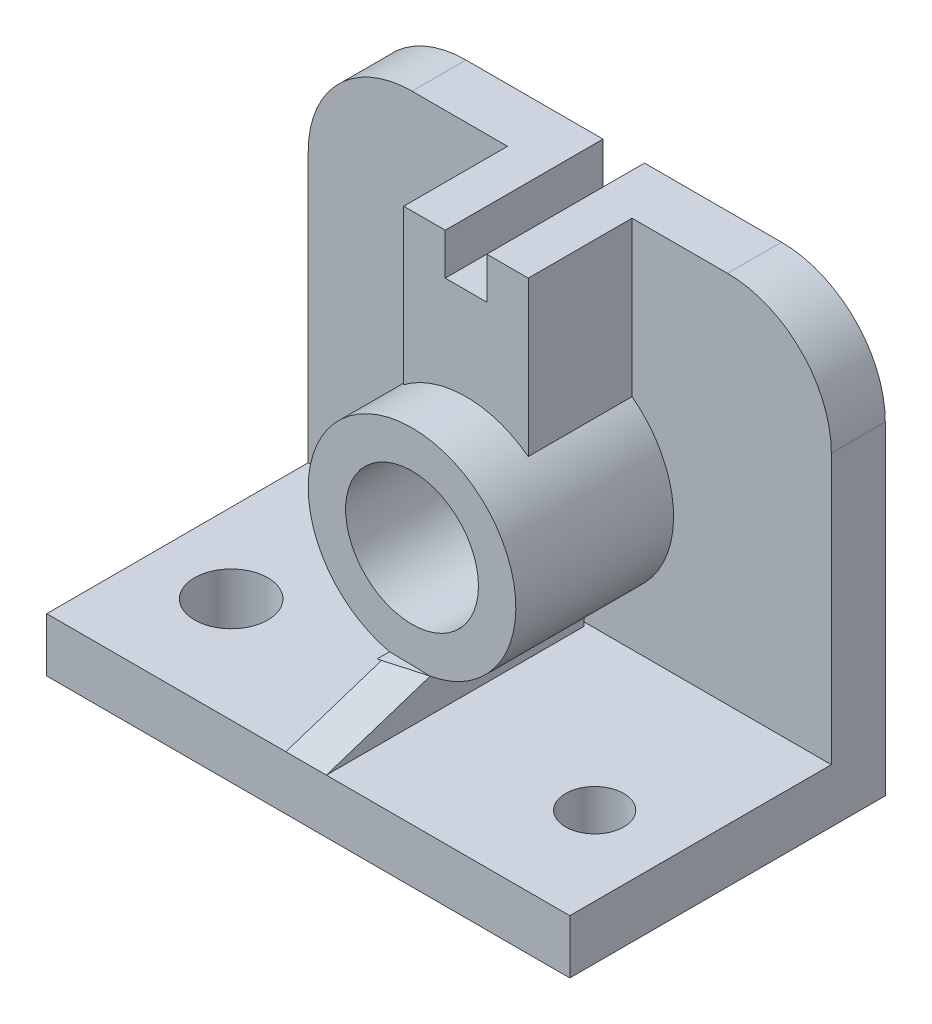
ISO-10303-21;
HEADER;
FILE_DESCRIPTION(('STEP AP214'),'2;1');
FILE_NAME('part.step','',(''),(''),'','','');
FILE_SCHEMA(('AUTOMOTIVE_DESIGN { 1 0 10303 214 1 1 1 1 }'));
ENDSEC;
DATA;
#1=APPLICATION_CONTEXT('core data for automotive mechanical design processes');
#2=APPLICATION_PROTOCOL_DEFINITION('international standard','automotive_design',2000,#1);
#3=PRODUCT_CONTEXT('',#1,'mechanical');
#4=PRODUCT('Part','Part','',(#3));
#5=PRODUCT_RELATED_PRODUCT_CATEGORY('part','',(#4));
#6=PRODUCT_DEFINITION_FORMATION('','',#4);
#7=PRODUCT_DEFINITION_CONTEXT('part definition',#1,'design');
#8=PRODUCT_DEFINITION('design','',#6,#7);
#9=PRODUCT_DEFINITION_SHAPE('','',#8);
#10=(LENGTH_UNIT() NAMED_UNIT(*) SI_UNIT(.MILLI.,.METRE.));
#11=(NAMED_UNIT(*) PLANE_ANGLE_UNIT() SI_UNIT($,.RADIAN.));
#12=(NAMED_UNIT(*) SI_UNIT($,.STERADIAN.) SOLID_ANGLE_UNIT());
#13=UNCERTAINTY_MEASURE_WITH_UNIT(LENGTH_MEASURE(1.E-05),#10,'distance_accuracy_value','');
#14=(GEOMETRIC_REPRESENTATION_CONTEXT(3) GLOBAL_UNCERTAINTY_ASSIGNED_CONTEXT((#13)) GLOBAL_UNIT_ASSIGNED_CONTEXT((#10,
#11,#12)) REPRESENTATION_CONTEXT('',''));
#15=CARTESIAN_POINT('',(0.,0.,0.));
#16=DIRECTION('',(0.,0.,1.));
#17=DIRECTION('',(1.,0.,0.));
#18=AXIS2_PLACEMENT_3D('',#15,#16,#17);
#19=CARTESIAN_POINT('',(9.06474820143882,45.7756538208969,51.5971223021583));
#20=DIRECTION('',(0.,0.,-1.));
#21=DIRECTION('',(-1.,0.,0.));
#22=AXIS2_PLACEMENT_3D('',#19,#20,#21);
#23=CYLINDRICAL_SURFACE('',#22,25.);
#24=CARTESIAN_POINT('',(9.06474820143882,45.7756538208969,38.5971223021583));
#25=DIRECTION('',(0.,0.,-1.));
#26=DIRECTION('',(1.,0.,0.));
#27=AXIS2_PLACEMENT_3D('',#24,#25,#26);
#28=CIRCLE('',#27,25.);
#29=CARTESIAN_POINT('',(-5.93525179856118,65.7756538208969,38.5971223021583));
#30=VERTEX_POINT('',#29);
#31=CARTESIAN_POINT('',(24.0647482014388,65.7756538208969,38.5971223021583));
#32=VERTEX_POINT('',#31);
#33=EDGE_CURVE('E319',#30,#32,#28,.T.);
#34=ORIENTED_EDGE('',*,*,#33,.F.);
#35=DIRECTION('',(0.,0.,-1.));
#36=VECTOR('',#35,1.);
#37=CARTESIAN_POINT('',(-5.93525179856118,65.7756538208969,38.5971223021583));
#38=LINE('',#37,#36);
#39=CARTESIAN_POINT('',(-5.93525179856117,65.7756538208969,13.5971223021583));
#40=VERTEX_POINT('',#39);
#41=EDGE_CURVE('E343',#30,#40,#38,.T.);
#42=ORIENTED_EDGE('',*,*,#41,.T.);
#43=CARTESIAN_POINT('',(9.06474820143882,45.7756538208969,13.5971223021583));
#44=DIRECTION('',(0.,0.,-1.));
#45=DIRECTION('',(-1.,0.,0.));
#46=AXIS2_PLACEMENT_3D('',#43,#44,#45);
#47=CIRCLE('',#46,25.);
#48=CARTESIAN_POINT('',(24.0647482014388,65.7756538208969,13.5971223021583));
#49=VERTEX_POINT('',#48);
#50=EDGE_CURVE('E301',#40,#49,#47,.F.);
#51=ORIENTED_EDGE('',*,*,#50,.T.);
#52=DIRECTION('',(0.,0.,-1.));
#53=VECTOR('',#52,1.);
#54=CARTESIAN_POINT('',(24.0647482014388,65.7756538208969,38.5971223021583));
#55=LINE('',#54,#53);
#56=EDGE_CURVE('E340',#32,#49,#55,.T.);
#57=ORIENTED_EDGE('',*,*,#56,.F.);
#58=EDGE_LOOP('',(#34,#42,#51,#57));
#59=FACE_BOUND('',#58,.T.);
#60=DIRECTION('',(0.,0.,-1.));
#61=VECTOR('',#60,1.);
#62=CARTESIAN_POINT('',(3.66037439900069,21.3667877308156,88.5971223021583));
#63=LINE('',#62,#61);
#64=CARTESIAN_POINT('',(3.66037439900069,21.3667877308156,51.5971223021583));
#65=VERTEX_POINT('',#64);
#66=CARTESIAN_POINT('',(3.66037439900069,21.3667877308156,14.5971223021583));
#67=VERTEX_POINT('',#66);
#68=EDGE_CURVE('E374',#65,#67,#63,.T.);
#69=ORIENTED_EDGE('',*,*,#68,.F.);
#70=CARTESIAN_POINT('',(9.06474820143882,45.7756538208969,51.5971223021583));
#71=DIRECTION('',(0.,0.,1.));
#72=DIRECTION('',(1.,0.,0.));
#73=AXIS2_PLACEMENT_3D('',#70,#71,#72);
#74=CIRCLE('',#73,25.);
#75=CARTESIAN_POINT('',(13.4310564952909,21.159899680854,51.5971223021583));
#76=VERTEX_POINT('',#75);
#77=EDGE_CURVE('E227',#76,#65,#74,.T.);
#78=ORIENTED_EDGE('',*,*,#77,.F.);
#79=DIRECTION('',(0.,0.,-1.));
#80=VECTOR('',#79,1.);
#81=CARTESIAN_POINT('',(13.4310564952909,21.159899680854,88.5971223021583));
#82=LINE('',#81,#80);
#83=CARTESIAN_POINT('',(13.4310564952909,21.159899680854,14.5971223021583));
#84=VERTEX_POINT('',#83);
#85=EDGE_CURVE('E213',#76,#84,#82,.T.);
#86=ORIENTED_EDGE('',*,*,#85,.T.);
#87=CARTESIAN_POINT('',(9.06474820143882,45.7756538208969,14.5971223021583));
#88=DIRECTION('',(0.,0.,1.));
#89=DIRECTION('',(1.,0.,0.));
#90=AXIS2_PLACEMENT_3D('',#87,#88,#89);
#91=CIRCLE('',#90,25.);
#92=EDGE_CURVE('E208',#67,#84,#91,.T.);
#93=ORIENTED_EDGE('',*,*,#92,.F.);
#94=EDGE_LOOP('',(#69,#78,#86,#93));
#95=FACE_BOUND('',#94,.T.);
#96=ADVANCED_FACE('F36',(#59,#95),#23,.T.);
#97=CARTESIAN_POINT('',(0.,13.,0.));
#98=DIRECTION('',(0.,1.,0.));
#99=DIRECTION('',(0.,0.,1.));
#100=AXIS2_PLACEMENT_3D('',#97,#98,#99);
#101=PLANE('',#100);
#102=CARTESIAN_POINT('',(53.0647482014388,13.,51.5971223021583));
#103=DIRECTION('',(0.,1.,0.));
#104=DIRECTION('',(0.,0.,1.));
#105=AXIS2_PLACEMENT_3D('',#102,#103,#104);
#106=CIRCLE('',#105,7.);
#107=CARTESIAN_POINT('',(53.0647482014388,13.,58.5971223021583));
#108=VERTEX_POINT('',#107);
#109=EDGE_CURVE('E211',#108,#108,#106,.T.);
#110=ORIENTED_EDGE('',*,*,#109,.F.);
#111=EDGE_LOOP('',(#110));
#112=FACE_BOUND('',#111,.T.);
#113=CARTESIAN_POINT('',(-34.8088545675727,13.,51.2901142982248));
#114=DIRECTION('',(0.,1.,0.));
#115=DIRECTION('',(0.,0.,1.));
#116=AXIS2_PLACEMENT_3D('',#113,#114,#115);
#117=CIRCLE('',#116,8.82990747552434);
#118=CARTESIAN_POINT('',(-34.8088545675727,13.,60.1200217737491));
#119=VERTEX_POINT('',#118);
#120=EDGE_CURVE('E220',#119,#119,#117,.T.);
#121=ORIENTED_EDGE('',*,*,#120,.F.);
#122=EDGE_LOOP('',(#121));
#123=FACE_BOUND('',#122,.T.);
#124=DIRECTION('',(1.,0.,0.));
#125=VECTOR('',#124,1.);
#126=CARTESIAN_POINT('',(-53.9352517985612,13.,76.5971223021583));
#127=LINE('',#126,#125);
#128=CARTESIAN_POINT('',(-53.9352517985612,13.,76.5971223021583));
#129=VERTEX_POINT('',#128);
#130=CARTESIAN_POINT('',(3.66037439900069,13.,76.5971223021583));
#131=VERTEX_POINT('',#130);
#132=EDGE_CURVE('E176',#129,#131,#127,.T.);
#133=ORIENTED_EDGE('',*,*,#132,.T.);
#134=DIRECTION('',(0.,0.,-1.));
#135=VECTOR('',#134,1.);
#136=CARTESIAN_POINT('',(3.66037439900069,13.,88.5971223021583));
#137=LINE('',#136,#135);
#138=CARTESIAN_POINT('',(3.66037439900069,13.,14.5971223021583));
#139=VERTEX_POINT('',#138);
#140=EDGE_CURVE('E56',#131,#139,#137,.T.);
#141=ORIENTED_EDGE('',*,*,#140,.T.);
#142=DIRECTION('',(1.,0.,0.));
#143=VECTOR('',#142,1.);
#144=CARTESIAN_POINT('',(13.4310564952909,13.,14.5971223021583));
#145=LINE('',#144,#143);
#146=CARTESIAN_POINT('',(13.4310564952909,13.,14.5971223021583));
#147=VERTEX_POINT('',#146);
#148=EDGE_CURVE('E51',#139,#147,#145,.T.);
#149=ORIENTED_EDGE('',*,*,#148,.T.);
#150=DIRECTION('',(0.,0.,-1.));
#151=VECTOR('',#150,1.);
#152=CARTESIAN_POINT('',(13.4310564952909,13.,88.5971223021583));
#153=LINE('',#152,#151);
#154=CARTESIAN_POINT('',(13.4310564952909,13.,76.5971223021583));
#155=VERTEX_POINT('',#154);
#156=EDGE_CURVE('E209',#155,#147,#153,.T.);
#157=ORIENTED_EDGE('',*,*,#156,.F.);
#158=CARTESIAN_POINT('',(72.0647482014388,13.,76.5971223021583));
#159=VERTEX_POINT('',#158);
#160=EDGE_CURVE('E189',#155,#159,#127,.T.);
#161=ORIENTED_EDGE('',*,*,#160,.T.);
#162=DIRECTION('',(0.,0.,-1.));
#163=VECTOR('',#162,1.);
#164=CARTESIAN_POINT('',(72.0647482014388,13.,0.59712230215829));
#165=LINE('',#164,#163);
#166=CARTESIAN_POINT('',(72.0647482014388,13.,13.5971223021583));
#167=VERTEX_POINT('',#166);
#168=EDGE_CURVE('E278',#159,#167,#165,.T.);
#169=ORIENTED_EDGE('',*,*,#168,.T.);
#170=DIRECTION('',(-1.,0.,0.));
#171=VECTOR('',#170,1.);
#172=CARTESIAN_POINT('',(72.0647482014388,13.,13.5971223021583));
#173=LINE('',#172,#171);
#174=CARTESIAN_POINT('',(-53.9352517985612,13.,13.5971223021583));
#175=VERTEX_POINT('',#174);
#176=EDGE_CURVE('E280',#167,#175,#173,.T.);
#177=ORIENTED_EDGE('',*,*,#176,.T.);
#178=DIRECTION('',(0.,0.,1.));
#179=VECTOR('',#178,1.);
#180=CARTESIAN_POINT('',(-53.9352517985612,13.,0.59712230215829));
#181=LINE('',#180,#179);
#182=EDGE_CURVE('E181',#175,#129,#181,.T.);
#183=ORIENTED_EDGE('',*,*,#182,.T.);
#184=EDGE_LOOP('',(#133,#141,#149,#157,#161,#169,#177,#183));
#185=FACE_BOUND('',#184,.T.);
#186=ADVANCED_FACE('F178',(#112,#123,#185),#101,.T.);
#187=CARTESIAN_POINT('',(9.06474820143882,45.7756538208969,51.5971223021583));
#188=DIRECTION('',(0.,0.,1.));
#189=DIRECTION('',(1.,0.,0.));
#190=AXIS2_PLACEMENT_3D('',#187,#188,#189);
#191=PLANE('',#190);
#192=CARTESIAN_POINT('',(9.06474820143882,45.7756538208969,51.5971223021583));
#193=DIRECTION('',(0.,0.,1.));
#194=DIRECTION('',(1.,0.,0.));
#195=AXIS2_PLACEMENT_3D('',#192,#193,#194);
#196=CIRCLE('',#195,16.);
#197=CARTESIAN_POINT('',(25.0647482014388,45.7756538208969,51.5971223021583));
#198=VERTEX_POINT('',#197);
#199=EDGE_CURVE('E228',#198,#198,#196,.T.);
#200=ORIENTED_EDGE('',*,*,#199,.F.);
#201=EDGE_LOOP('',(#200));
#202=FACE_BOUND('',#201,.T.);
#203=ORIENTED_EDGE('',*,*,#77,.T.);
#204=DIRECTION('',(0.99977589835616,-0.0211696260272393,0.));
#205=VECTOR('',#204,1.);
#206=CARTESIAN_POINT('',(8.5457154471458,21.2633437058348,51.5971223021583));
#207=LINE('',#206,#205);
#208=EDGE_CURVE('E348',#65,#76,#207,.T.);
#209=ORIENTED_EDGE('',*,*,#208,.T.);
#210=EDGE_LOOP('',(#203,#209));
#211=FACE_BOUND('',#210,.T.);
#212=ADVANCED_FACE('F373',(#202,#211),#191,.T.);
#213=CARTESIAN_POINT('',(72.0647482014388,103.,13.5971223021583));
#214=DIRECTION('',(0.,1.,0.));
#215=DIRECTION('',(0.,0.,1.));
#216=AXIS2_PLACEMENT_3D('',#213,#214,#215);
#217=PLANE('',#216);
#218=DIRECTION('',(-1.,0.,0.));
#219=VECTOR('',#218,1.);
#220=CARTESIAN_POINT('',(4.06474820143882,103.,38.5971223021583));
#221=LINE('',#220,#219);
#222=CARTESIAN_POINT('',(4.06474820143882,103.,38.5971223021583));
#223=VERTEX_POINT('',#222);
#224=CARTESIAN_POINT('',(-5.93525179856118,103.,38.5971223021583));
#225=VERTEX_POINT('',#224);
#226=EDGE_CURVE('E313',#223,#225,#221,.T.);
#227=ORIENTED_EDGE('',*,*,#226,.F.);
#228=DIRECTION('',(0.,0.,1.));
#229=VECTOR('',#228,1.);
#230=CARTESIAN_POINT('',(4.06474820143882,103.,0.59712230215829));
#231=LINE('',#230,#229);
#232=CARTESIAN_POINT('',(4.06474820143882,103.,0.59712230215829));
#233=VERTEX_POINT('',#232);
#234=EDGE_CURVE('E297',#233,#223,#231,.T.);
#235=ORIENTED_EDGE('',*,*,#234,.F.);
#236=DIRECTION('',(1.,0.,0.));
#237=VECTOR('',#236,1.);
#238=CARTESIAN_POINT('',(72.0647482014388,103.,0.59712230215829));
#239=LINE('',#238,#237);
#240=CARTESIAN_POINT('',(-28.9352517985612,103.,0.59712230215829));
#241=VERTEX_POINT('',#240);
#242=EDGE_CURVE('E274',#241,#233,#239,.T.);
#243=ORIENTED_EDGE('',*,*,#242,.F.);
#244=DIRECTION('',(0.,0.,-1.));
#245=VECTOR('',#244,1.);
#246=CARTESIAN_POINT('',(-28.9352517985612,103.,13.5971223021583));
#247=LINE('',#246,#245);
#248=CARTESIAN_POINT('',(-28.9352517985612,103.,13.5971223021583));
#249=VERTEX_POINT('',#248);
#250=EDGE_CURVE('E233',#241,#249,#247,.F.);
#251=ORIENTED_EDGE('',*,*,#250,.T.);
#252=DIRECTION('',(1.,0.,0.));
#253=VECTOR('',#252,1.);
#254=CARTESIAN_POINT('',(72.0647482014388,103.,13.5971223021583));
#255=LINE('',#254,#253);
#256=CARTESIAN_POINT('',(-5.93525179856118,103.,13.5971223021583));
#257=VERTEX_POINT('',#256);
#258=EDGE_CURVE('E260',#249,#257,#255,.T.);
#259=ORIENTED_EDGE('',*,*,#258,.T.);
#260=DIRECTION('',(0.,0.,-1.));
#261=VECTOR('',#260,1.);
#262=CARTESIAN_POINT('',(-5.93525179856118,103.,38.5971223021583));
#263=LINE('',#262,#261);
#264=EDGE_CURVE('E345',#225,#257,#263,.T.);
#265=ORIENTED_EDGE('',*,*,#264,.F.);
#266=EDGE_LOOP('',(#227,#235,#243,#251,#259,#265));
#267=FACE_BOUND('',#266,.T.);
#268=ADVANCED_FACE('F456',(#267),#217,.T.);
#269=DIRECTION('',(0.,0.,-1.));
#270=VECTOR('',#269,1.);
#271=CARTESIAN_POINT('',(14.0647482014388,103.,0.59712230215829));
#272=LINE('',#271,#270);
#273=CARTESIAN_POINT('',(14.0647482014388,103.,38.5971223021583));
#274=VERTEX_POINT('',#273);
#275=CARTESIAN_POINT('',(14.0647482014388,103.,0.59712230215829));
#276=VERTEX_POINT('',#275);
#277=EDGE_CURVE('E296',#274,#276,#272,.T.);
#278=ORIENTED_EDGE('',*,*,#277,.F.);
#279=DIRECTION('',(-1.,0.,0.));
#280=VECTOR('',#279,1.);
#281=CARTESIAN_POINT('',(14.0647482014388,103.,38.5971223021583));
#282=LINE('',#281,#280);
#283=CARTESIAN_POINT('',(24.0647482014388,103.,38.5971223021583));
#284=VERTEX_POINT('',#283);
#285=EDGE_CURVE('E324',#284,#274,#282,.T.);
#286=ORIENTED_EDGE('',*,*,#285,.F.);
#287=DIRECTION('',(0.,0.,-1.));
#288=VECTOR('',#287,1.);
#289=CARTESIAN_POINT('',(24.0647482014388,103.,38.5971223021583));
#290=LINE('',#289,#288);
#291=CARTESIAN_POINT('',(24.0647482014388,103.,13.5971223021583));
#292=VERTEX_POINT('',#291);
#293=EDGE_CURVE('E333',#284,#292,#290,.T.);
#294=ORIENTED_EDGE('',*,*,#293,.T.);
#295=CARTESIAN_POINT('',(47.0647482014388,103.,13.5971223021583));
#296=VERTEX_POINT('',#295);
#297=EDGE_CURVE('E255',#292,#296,#255,.T.);
#298=ORIENTED_EDGE('',*,*,#297,.T.);
#299=DIRECTION('',(0.,0.,-1.));
#300=VECTOR('',#299,1.);
#301=CARTESIAN_POINT('',(47.0647482014388,103.,0.597122302158295));
#302=LINE('',#301,#300);
#303=CARTESIAN_POINT('',(47.0647482014388,103.,0.59712230215829));
#304=VERTEX_POINT('',#303);
#305=EDGE_CURVE('E244',#296,#304,#302,.T.);
#306=ORIENTED_EDGE('',*,*,#305,.T.);
#307=EDGE_CURVE('E252',#276,#304,#239,.T.);
#308=ORIENTED_EDGE('',*,*,#307,.F.);
#309=EDGE_LOOP('',(#278,#286,#294,#298,#306,#308));
#310=FACE_BOUND('',#309,.T.);
#311=ADVANCED_FACE('F38',(#310),#217,.T.);
#312=CARTESIAN_POINT('',(-5.93525179856118,103.,38.5971223021583));
#313=DIRECTION('',(1.,0.,0.));
#314=DIRECTION('',(0.,1.,0.));
#315=AXIS2_PLACEMENT_3D('',#312,#313,#314);
#316=PLANE('',#315);
#317=DIRECTION('',(0.,-1.,0.));
#318=VECTOR('',#317,1.);
#319=CARTESIAN_POINT('',(-5.93525179856118,103.,13.5971223021583));
#320=LINE('',#319,#318);
#321=EDGE_CURVE('E309',#257,#40,#320,.T.);
#322=ORIENTED_EDGE('',*,*,#321,.T.);
#323=ORIENTED_EDGE('',*,*,#41,.F.);
#324=DIRECTION('',(0.,-1.,0.));
#325=VECTOR('',#324,1.);
#326=CARTESIAN_POINT('',(-5.93525179856118,103.,38.5971223021583));
#327=LINE('',#326,#325);
#328=EDGE_CURVE('E316',#225,#30,#327,.T.);
#329=ORIENTED_EDGE('',*,*,#328,.F.);
#330=ORIENTED_EDGE('',*,*,#264,.T.);
#331=EDGE_LOOP('',(#322,#323,#329,#330));
#332=FACE_BOUND('',#331,.T.);
#333=ADVANCED_FACE('F449',(#332),#316,.F.);
#334=CARTESIAN_POINT('',(24.0647482014388,103.,38.5971223021583));
#335=DIRECTION('',(-1.,0.,0.));
#336=DIRECTION('',(0.,0.,1.));
#337=AXIS2_PLACEMENT_3D('',#334,#335,#336);
#338=PLANE('',#337);
#339=DIRECTION('',(0.,1.,0.));
#340=VECTOR('',#339,1.);
#341=CARTESIAN_POINT('',(24.0647482014388,103.,13.5971223021583));
#342=LINE('',#341,#340);
#343=EDGE_CURVE('E314',#49,#292,#342,.T.);
#344=ORIENTED_EDGE('',*,*,#343,.T.);
#345=ORIENTED_EDGE('',*,*,#293,.F.);
#346=DIRECTION('',(0.,1.,0.));
#347=VECTOR('',#346,1.);
#348=CARTESIAN_POINT('',(24.0647482014388,103.,38.5971223021583));
#349=LINE('',#348,#347);
#350=EDGE_CURVE('E322',#32,#284,#349,.T.);
#351=ORIENTED_EDGE('',*,*,#350,.F.);
#352=ORIENTED_EDGE('',*,*,#56,.T.);
#353=EDGE_LOOP('',(#344,#345,#351,#352));
#354=FACE_BOUND('',#353,.T.);
#355=ADVANCED_FACE('F446',(#354),#338,.F.);
#356=CARTESIAN_POINT('',(9.06474820143882,45.7756538208969,38.5971223021583));
#357=DIRECTION('',(0.,0.,1.));
#358=DIRECTION('',(1.,0.,0.));
#359=AXIS2_PLACEMENT_3D('',#356,#357,#358);
#360=PLANE('',#359);
#361=DIRECTION('',(0.,1.,0.));
#362=VECTOR('',#361,1.);
#363=CARTESIAN_POINT('',(4.06474820143882,93.,38.5971223021583));
#364=LINE('',#363,#362);
#365=CARTESIAN_POINT('',(4.06474820143882,93.,38.5971223021583));
#366=VERTEX_POINT('',#365);
#367=EDGE_CURVE('E310',#366,#223,#364,.T.);
#368=ORIENTED_EDGE('',*,*,#367,.T.);
#369=ORIENTED_EDGE('',*,*,#226,.T.);
#370=ORIENTED_EDGE('',*,*,#328,.T.);
#371=ORIENTED_EDGE('',*,*,#33,.T.);
#372=ORIENTED_EDGE('',*,*,#350,.T.);
#373=ORIENTED_EDGE('',*,*,#285,.T.);
#374=DIRECTION('',(0.,-1.,0.));
#375=VECTOR('',#374,1.);
#376=CARTESIAN_POINT('',(14.0647482014388,103.,38.5971223021583));
#377=LINE('',#376,#375);
#378=CARTESIAN_POINT('',(14.0647482014388,93.,38.5971223021583));
#379=VERTEX_POINT('',#378);
#380=EDGE_CURVE('E327',#274,#379,#377,.T.);
#381=ORIENTED_EDGE('',*,*,#380,.T.);
#382=DIRECTION('',(-1.,0.,0.));
#383=VECTOR('',#382,1.);
#384=CARTESIAN_POINT('',(14.0647482014388,93.,38.5971223021583));
#385=LINE('',#384,#383);
#386=EDGE_CURVE('E330',#379,#366,#385,.T.);
#387=ORIENTED_EDGE('',*,*,#386,.T.);
#388=EDGE_LOOP('',(#368,#369,#370,#371,#372,#373,#381,#387));
#389=FACE_BOUND('',#388,.T.);
#390=ADVANCED_FACE('F430',(#389),#360,.T.);
#391=CARTESIAN_POINT('',(0.,0.,13.5971223021583));
#392=DIRECTION('',(0.,0.,-1.));
#393=DIRECTION('',(-1.,0.,0.));
#394=AXIS2_PLACEMENT_3D('',#391,#392,#393);
#395=PLANE('',#394);
#396=ORIENTED_EDGE('',*,*,#50,.F.);
#397=ORIENTED_EDGE('',*,*,#321,.F.);
#398=ORIENTED_EDGE('',*,*,#258,.F.);
#399=CARTESIAN_POINT('',(-28.9352517985612,78.,13.5971223021583));
#400=DIRECTION('',(0.,0.,-1.));
#401=DIRECTION('',(-1.,0.,0.));
#402=AXIS2_PLACEMENT_3D('',#399,#400,#401);
#403=CIRCLE('',#402,25.);
#404=CARTESIAN_POINT('',(-53.9352517985612,78.,13.5971223021583));
#405=VERTEX_POINT('',#404);
#406=EDGE_CURVE('E242',#249,#405,#403,.F.);
#407=ORIENTED_EDGE('',*,*,#406,.T.);
#408=DIRECTION('',(0.,1.,0.));
#409=VECTOR('',#408,1.);
#410=CARTESIAN_POINT('',(-53.9352517985612,13.,13.5971223021583));
#411=LINE('',#410,#409);
#412=EDGE_CURVE('E186',#175,#405,#411,.T.);
#413=ORIENTED_EDGE('',*,*,#412,.F.);
#414=ORIENTED_EDGE('',*,*,#176,.F.);
#415=DIRECTION('',(0.,-1.,0.));
#416=VECTOR('',#415,1.);
#417=CARTESIAN_POINT('',(72.0647482014388,13.,13.5971223021583));
#418=LINE('',#417,#416);
#419=CARTESIAN_POINT('',(72.0647482014388,78.,13.5971223021583));
#420=VERTEX_POINT('',#419);
#421=EDGE_CURVE('E247',#420,#167,#418,.T.);
#422=ORIENTED_EDGE('',*,*,#421,.F.);
#423=CARTESIAN_POINT('',(47.0647482014388,78.,13.5971223021583));
#424=DIRECTION('',(0.,0.,-1.));
#425=DIRECTION('',(-1.,0.,0.));
#426=AXIS2_PLACEMENT_3D('',#423,#424,#425);
#427=CIRCLE('',#426,25.);
#428=EDGE_CURVE('E238',#420,#296,#427,.F.);
#429=ORIENTED_EDGE('',*,*,#428,.T.);
#430=ORIENTED_EDGE('',*,*,#297,.F.);
#431=ORIENTED_EDGE('',*,*,#343,.F.);
#432=EDGE_LOOP('',(#396,#397,#398,#407,#413,#414,#422,#429,#430,#431));
#433=FACE_BOUND('',#432,.T.);
#434=ADVANCED_FACE('F413',(#433),#395,.F.);
#435=CARTESIAN_POINT('',(-53.9352517985612,13.,0.59712230215829));
#436=DIRECTION('',(1.,0.,0.));
#437=DIRECTION('',(0.,0.,-1.));
#438=AXIS2_PLACEMENT_3D('',#435,#436,#437);
#439=PLANE('',#438);
#440=ORIENTED_EDGE('',*,*,#412,.T.);
#441=DIRECTION('',(0.,0.,-1.));
#442=VECTOR('',#441,1.);
#443=CARTESIAN_POINT('',(-53.9352517985612,78.,0.59712230215829));
#444=LINE('',#443,#442);
#445=CARTESIAN_POINT('',(-53.9352517985612,78.,0.59712230215829));
#446=VERTEX_POINT('',#445);
#447=EDGE_CURVE('E234',#405,#446,#444,.T.);
#448=ORIENTED_EDGE('',*,*,#447,.T.);
#449=DIRECTION('',(0.,-1.,0.));
#450=VECTOR('',#449,1.);
#451=CARTESIAN_POINT('',(-53.9352517985612,13.,0.59712230215829));
#452=LINE('',#451,#450);
#453=CARTESIAN_POINT('',(-53.9352517985612,0.,0.59712230215829));
#454=VERTEX_POINT('',#453);
#455=EDGE_CURVE('E237',#446,#454,#452,.T.);
#456=ORIENTED_EDGE('',*,*,#455,.T.);
#457=DIRECTION('',(0.,0.,1.));
#458=VECTOR('',#457,1.);
#459=CARTESIAN_POINT('',(-53.9352517985612,0.,0.59712230215829));
#460=LINE('',#459,#458);
#461=CARTESIAN_POINT('',(-53.9352517985612,0.,76.5971223021583));
#462=VERTEX_POINT('',#461);
#463=EDGE_CURVE('E269',#454,#462,#460,.T.);
#464=ORIENTED_EDGE('',*,*,#463,.T.);
#465=DIRECTION('',(0.,-1.,0.));
#466=VECTOR('',#465,1.);
#467=CARTESIAN_POINT('',(-53.9352517985612,13.,76.5971223021583));
#468=LINE('',#467,#466);
#469=EDGE_CURVE('E248',#129,#462,#468,.T.);
#470=ORIENTED_EDGE('',*,*,#469,.F.);
#471=ORIENTED_EDGE('',*,*,#182,.F.);
#472=EDGE_LOOP('',(#440,#448,#456,#464,#470,#471));
#473=FACE_BOUND('',#472,.T.);
#474=ADVANCED_FACE('F410',(#473),#439,.F.);
#475=CARTESIAN_POINT('',(-53.9352517985612,13.,76.5971223021583));
#476=DIRECTION('',(0.,0.,-1.));
#477=DIRECTION('',(-1.,0.,0.));
#478=AXIS2_PLACEMENT_3D('',#475,#476,#477);
#479=PLANE('',#478);
#480=DIRECTION('',(1.,0.,0.));
#481=VECTOR('',#480,1.);
#482=CARTESIAN_POINT('',(-53.9352517985612,0.,76.5971223021583));
#483=LINE('',#482,#481);
#484=CARTESIAN_POINT('',(72.0647482014388,0.,76.5971223021583));
#485=VERTEX_POINT('',#484);
#486=EDGE_CURVE('E262',#462,#485,#483,.T.);
#487=ORIENTED_EDGE('',*,*,#486,.T.);
#488=DIRECTION('',(0.,-1.,0.));
#489=VECTOR('',#488,1.);
#490=CARTESIAN_POINT('',(72.0647482014388,13.,76.5971223021583));
#491=LINE('',#490,#489);
#492=EDGE_CURVE('E263',#159,#485,#491,.T.);
#493=ORIENTED_EDGE('',*,*,#492,.F.);
#494=ORIENTED_EDGE('',*,*,#160,.F.);
#495=EDGE_CURVE('E187',#131,#155,#127,.T.);
#496=ORIENTED_EDGE('',*,*,#495,.F.);
#497=ORIENTED_EDGE('',*,*,#132,.F.);
#498=ORIENTED_EDGE('',*,*,#469,.T.);
#499=EDGE_LOOP('',(#487,#493,#494,#496,#497,#498));
#500=FACE_BOUND('',#499,.T.);
#501=ADVANCED_FACE('F203',(#500),#479,.F.);
#502=CARTESIAN_POINT('',(72.0647482014388,13.,0.59712230215829));
#503=DIRECTION('',(-1.,0.,0.));
#504=DIRECTION('',(0.,0.,1.));
#505=AXIS2_PLACEMENT_3D('',#502,#503,#504);
#506=PLANE('',#505);
#507=DIRECTION('',(0.,-1.,0.));
#508=VECTOR('',#507,1.);
#509=CARTESIAN_POINT('',(72.0647482014388,13.,0.59712230215829));
#510=LINE('',#509,#508);
#511=CARTESIAN_POINT('',(72.0647482014388,78.,0.59712230215829));
#512=VERTEX_POINT('',#511);
#513=CARTESIAN_POINT('',(72.0647482014388,0.,0.59712230215829));
#514=VERTEX_POINT('',#513);
#515=EDGE_CURVE('E251',#512,#514,#510,.T.);
#516=ORIENTED_EDGE('',*,*,#515,.F.);
#517=DIRECTION('',(0.,0.,-1.));
#518=VECTOR('',#517,1.);
#519=CARTESIAN_POINT('',(72.0647482014388,78.,13.5971223021583));
#520=LINE('',#519,#518);
#521=EDGE_CURVE('E245',#512,#420,#520,.F.);
#522=ORIENTED_EDGE('',*,*,#521,.T.);
#523=ORIENTED_EDGE('',*,*,#421,.T.);
#524=ORIENTED_EDGE('',*,*,#168,.F.);
#525=ORIENTED_EDGE('',*,*,#492,.T.);
#526=DIRECTION('',(0.,0.,-1.));
#527=VECTOR('',#526,1.);
#528=CARTESIAN_POINT('',(72.0647482014388,0.,0.59712230215829));
#529=LINE('',#528,#527);
#530=EDGE_CURVE('E266',#485,#514,#529,.T.);
#531=ORIENTED_EDGE('',*,*,#530,.T.);
#532=EDGE_LOOP('',(#516,#522,#523,#524,#525,#531));
#533=FACE_BOUND('',#532,.T.);
#534=ADVANCED_FACE('F417',(#533),#506,.F.);
#535=CARTESIAN_POINT('',(-53.9352517985612,13.,0.59712230215829));
#536=DIRECTION('',(0.,0.,1.));
#537=DIRECTION('',(1.,0.,0.));
#538=AXIS2_PLACEMENT_3D('',#535,#536,#537);
#539=PLANE('',#538);
#540=ORIENTED_EDGE('',*,*,#242,.T.);
#541=DIRECTION('',(0.,1.,0.));
#542=VECTOR('',#541,1.);
#543=CARTESIAN_POINT('',(4.06474820143882,93.,0.59712230215829));
#544=LINE('',#543,#542);
#545=CARTESIAN_POINT('',(4.06474820143882,93.,0.59712230215829));
#546=VERTEX_POINT('',#545);
#547=EDGE_CURVE('E294',#546,#233,#544,.T.);
#548=ORIENTED_EDGE('',*,*,#547,.F.);
#549=DIRECTION('',(-1.,0.,0.));
#550=VECTOR('',#549,1.);
#551=CARTESIAN_POINT('',(4.06474820143882,93.,0.59712230215829));
#552=LINE('',#551,#550);
#553=CARTESIAN_POINT('',(14.0647482014388,93.,0.59712230215829));
#554=VERTEX_POINT('',#553);
#555=EDGE_CURVE('E303',#554,#546,#552,.T.);
#556=ORIENTED_EDGE('',*,*,#555,.F.);
#557=DIRECTION('',(0.,1.,0.));
#558=VECTOR('',#557,1.);
#559=CARTESIAN_POINT('',(14.0647482014388,93.,0.59712230215829));
#560=LINE('',#559,#558);
#561=EDGE_CURVE('E285',#554,#276,#560,.T.);
#562=ORIENTED_EDGE('',*,*,#561,.T.);
#563=ORIENTED_EDGE('',*,*,#307,.T.);
#564=CARTESIAN_POINT('',(47.0647482014388,78.,0.59712230215829));
#565=DIRECTION('',(0.,0.,1.));
#566=DIRECTION('',(1.,0.,0.));
#567=AXIS2_PLACEMENT_3D('',#564,#565,#566);
#568=CIRCLE('',#567,25.);
#569=EDGE_CURVE('E249',#304,#512,#568,.F.);
#570=ORIENTED_EDGE('',*,*,#569,.T.);
#571=ORIENTED_EDGE('',*,*,#515,.T.);
#572=DIRECTION('',(-1.,0.,0.));
#573=VECTOR('',#572,1.);
#574=CARTESIAN_POINT('',(-53.9352517985612,0.,0.59712230215829));
#575=LINE('',#574,#573);
#576=EDGE_CURVE('E256',#514,#454,#575,.T.);
#577=ORIENTED_EDGE('',*,*,#576,.T.);
#578=ORIENTED_EDGE('',*,*,#455,.F.);
#579=CARTESIAN_POINT('',(-28.9352517985612,78.,0.59712230215829));
#580=DIRECTION('',(0.,0.,1.));
#581=DIRECTION('',(1.,0.,0.));
#582=AXIS2_PLACEMENT_3D('',#579,#580,#581);
#583=CIRCLE('',#582,25.);
#584=EDGE_CURVE('E253',#446,#241,#583,.F.);
#585=ORIENTED_EDGE('',*,*,#584,.T.);
#586=EDGE_LOOP('',(#540,#548,#556,#562,#563,#570,#571,#577,#578,#585));
#587=FACE_BOUND('',#586,.T.);
#588=ADVANCED_FACE('F420',(#587),#539,.F.);
#589=CARTESIAN_POINT('',(0.,0.,0.));
#590=DIRECTION('',(0.,1.,0.));
#591=DIRECTION('',(0.,0.,1.));
#592=AXIS2_PLACEMENT_3D('',#589,#590,#591);
#593=PLANE('',#592);
#594=CARTESIAN_POINT('',(53.0647482014388,0.,51.5971223021583));
#595=DIRECTION('',(0.,1.,0.));
#596=DIRECTION('',(0.,0.,1.));
#597=AXIS2_PLACEMENT_3D('',#594,#595,#596);
#598=CIRCLE('',#597,7.);
#599=CARTESIAN_POINT('',(53.0647482014388,0.,58.5971223021583));
#600=VERTEX_POINT('',#599);
#601=EDGE_CURVE('E219',#600,#600,#598,.T.);
#602=ORIENTED_EDGE('',*,*,#601,.T.);
#603=EDGE_LOOP('',(#602));
#604=FACE_BOUND('',#603,.T.);
#605=CARTESIAN_POINT('',(-34.8088545675727,0.,51.2901142982248));
#606=DIRECTION('',(0.,1.,0.));
#607=DIRECTION('',(0.,0.,1.));
#608=AXIS2_PLACEMENT_3D('',#605,#606,#607);
#609=CIRCLE('',#608,8.82990747552434);
#610=CARTESIAN_POINT('',(-34.8088545675727,0.,60.1200217737491));
#611=VERTEX_POINT('',#610);
#612=EDGE_CURVE('E223',#611,#611,#609,.T.);
#613=ORIENTED_EDGE('',*,*,#612,.T.);
#614=EDGE_LOOP('',(#613));
#615=FACE_BOUND('',#614,.T.);
#616=ORIENTED_EDGE('',*,*,#463,.F.);
#617=ORIENTED_EDGE('',*,*,#576,.F.);
#618=ORIENTED_EDGE('',*,*,#530,.F.);
#619=ORIENTED_EDGE('',*,*,#486,.F.);
#620=EDGE_LOOP('',(#616,#617,#618,#619));
#621=FACE_BOUND('',#620,.T.);
#622=ADVANCED_FACE('F408',(#604,#615,#621),#593,.F.);
#623=CARTESIAN_POINT('',(47.0647482014388,78.,13.5971223021583));
#624=DIRECTION('',(0.,0.,1.));
#625=DIRECTION('',(1.,0.,0.));
#626=AXIS2_PLACEMENT_3D('',#623,#624,#625);
#627=CYLINDRICAL_SURFACE('',#626,25.);
#628=ORIENTED_EDGE('',*,*,#428,.F.);
#629=ORIENTED_EDGE('',*,*,#521,.F.);
#630=ORIENTED_EDGE('',*,*,#569,.F.);
#631=ORIENTED_EDGE('',*,*,#305,.F.);
#632=EDGE_LOOP('',(#628,#629,#630,#631));
#633=FACE_BOUND('',#632,.T.);
#634=ADVANCED_FACE('F404',(#633),#627,.T.);
#635=CARTESIAN_POINT('',(-28.9352517985612,78.,0.597122302158288));
#636=DIRECTION('',(0.,0.,1.));
#637=DIRECTION('',(1.,0.,0.));
#638=AXIS2_PLACEMENT_3D('',#635,#636,#637);
#639=CYLINDRICAL_SURFACE('',#638,25.);
#640=ORIENTED_EDGE('',*,*,#406,.F.);
#641=ORIENTED_EDGE('',*,*,#250,.F.);
#642=ORIENTED_EDGE('',*,*,#584,.F.);
#643=ORIENTED_EDGE('',*,*,#447,.F.);
#644=EDGE_LOOP('',(#640,#641,#642,#643));
#645=FACE_BOUND('',#644,.T.);
#646=ADVANCED_FACE('F400',(#645),#639,.T.);
#647=CARTESIAN_POINT('',(0.,93.,0.));
#648=DIRECTION('',(0.,-1.,0.));
#649=DIRECTION('',(0.,0.,-1.));
#650=AXIS2_PLACEMENT_3D('',#647,#648,#649);
#651=PLANE('',#650);
#652=DIRECTION('',(0.,0.,1.));
#653=VECTOR('',#652,1.);
#654=CARTESIAN_POINT('',(4.06474820143882,93.,0.59712230215829));
#655=LINE('',#654,#653);
#656=EDGE_CURVE('E299',#546,#366,#655,.T.);
#657=ORIENTED_EDGE('',*,*,#656,.T.);
#658=ORIENTED_EDGE('',*,*,#386,.F.);
#659=DIRECTION('',(0.,0.,-1.));
#660=VECTOR('',#659,1.);
#661=CARTESIAN_POINT('',(14.0647482014388,93.,0.59712230215829));
#662=LINE('',#661,#660);
#663=EDGE_CURVE('E241',#379,#554,#662,.T.);
#664=ORIENTED_EDGE('',*,*,#663,.T.);
#665=ORIENTED_EDGE('',*,*,#555,.T.);
#666=EDGE_LOOP('',(#657,#658,#664,#665));
#667=FACE_BOUND('',#666,.T.);
#668=ADVANCED_FACE('F403',(#667),#651,.F.);
#669=CARTESIAN_POINT('',(4.06474820143882,93.,0.59712230215829));
#670=DIRECTION('',(-1.,0.,0.));
#671=DIRECTION('',(0.,0.,1.));
#672=AXIS2_PLACEMENT_3D('',#669,#670,#671);
#673=PLANE('',#672);
#674=ORIENTED_EDGE('',*,*,#234,.T.);
#675=ORIENTED_EDGE('',*,*,#367,.F.);
#676=ORIENTED_EDGE('',*,*,#656,.F.);
#677=ORIENTED_EDGE('',*,*,#547,.T.);
#678=EDGE_LOOP('',(#674,#675,#676,#677));
#679=FACE_BOUND('',#678,.T.);
#680=ADVANCED_FACE('F436',(#679),#673,.F.);
#681=CARTESIAN_POINT('',(14.0647482014388,93.,0.59712230215829));
#682=DIRECTION('',(1.,0.,0.));
#683=DIRECTION('',(0.,0.,-1.));
#684=AXIS2_PLACEMENT_3D('',#681,#682,#683);
#685=PLANE('',#684);
#686=ORIENTED_EDGE('',*,*,#277,.T.);
#687=ORIENTED_EDGE('',*,*,#561,.F.);
#688=ORIENTED_EDGE('',*,*,#663,.F.);
#689=ORIENTED_EDGE('',*,*,#380,.F.);
#690=EDGE_LOOP('',(#686,#687,#688,#689));
#691=FACE_BOUND('',#690,.T.);
#692=ADVANCED_FACE('F432',(#691),#685,.F.);
#693=CARTESIAN_POINT('',(9.06474820143882,45.7756538208969,13.5971223021583));
#694=DIRECTION('',(0.,0.,1.));
#695=DIRECTION('',(1.,0.,0.));
#696=AXIS2_PLACEMENT_3D('',#693,#694,#695);
#697=CYLINDRICAL_SURFACE('',#696,16.);
#698=CARTESIAN_POINT('',(9.06474820143882,45.7756538208969,13.5971223021583));
#699=DIRECTION('',(0.,0.,1.));
#700=DIRECTION('',(1.,0.,0.));
#701=AXIS2_PLACEMENT_3D('',#698,#699,#700);
#702=CIRCLE('',#701,16.);
#703=CARTESIAN_POINT('',(25.0647482014388,45.7756538208969,13.5971223021583));
#704=VERTEX_POINT('',#703);
#705=EDGE_CURVE('E224',#704,#704,#702,.T.);
#706=ORIENTED_EDGE('',*,*,#705,.F.);
#707=EDGE_LOOP('',(#706));
#708=FACE_BOUND('',#707,.T.);
#709=ORIENTED_EDGE('',*,*,#199,.T.);
#710=EDGE_LOOP('',(#709));
#711=FACE_BOUND('',#710,.T.);
#712=ADVANCED_FACE('F435',(#708,#711),#697,.F.);
#713=CARTESIAN_POINT('',(9.06474820143882,45.7756538208969,13.5971223021583));
#714=DIRECTION('',(0.,0.,1.));
#715=DIRECTION('',(1.,0.,0.));
#716=AXIS2_PLACEMENT_3D('',#713,#714,#715);
#717=PLANE('',#716);
#718=ORIENTED_EDGE('',*,*,#705,.T.);
#719=EDGE_LOOP('',(#718));
#720=FACE_BOUND('',#719,.T.);
#721=ADVANCED_FACE('F502',(#720),#717,.T.);
#722=CARTESIAN_POINT('',(-34.8088545675727,-1.,51.2901142982248));
#723=DIRECTION('',(0.,1.,0.));
#724=DIRECTION('',(0.,0.,1.));
#725=AXIS2_PLACEMENT_3D('',#722,#723,#724);
#726=CYLINDRICAL_SURFACE('',#725,8.82990747552434);
#727=ORIENTED_EDGE('',*,*,#120,.T.);
#728=EDGE_LOOP('',(#727));
#729=FACE_BOUND('',#728,.T.);
#730=ORIENTED_EDGE('',*,*,#612,.F.);
#731=EDGE_LOOP('',(#730));
#732=FACE_BOUND('',#731,.T.);
#733=ADVANCED_FACE('F492',(#729,#732),#726,.F.);
#734=CARTESIAN_POINT('',(53.0647482014388,-21.,51.5971223021583));
#735=DIRECTION('',(0.,1.,0.));
#736=DIRECTION('',(0.,0.,1.));
#737=AXIS2_PLACEMENT_3D('',#734,#735,#736);
#738=CYLINDRICAL_SURFACE('',#737,7.);
#739=ORIENTED_EDGE('',*,*,#109,.T.);
#740=EDGE_LOOP('',(#739));
#741=FACE_BOUND('',#740,.T.);
#742=ORIENTED_EDGE('',*,*,#601,.F.);
#743=EDGE_LOOP('',(#742));
#744=FACE_BOUND('',#743,.T.);
#745=ADVANCED_FACE('F486',(#741,#744),#738,.F.);
#746=CARTESIAN_POINT('',(0.,0.,14.5971223021583));
#747=DIRECTION('',(0.,0.,1.));
#748=DIRECTION('',(1.,0.,0.));
#749=AXIS2_PLACEMENT_3D('',#746,#747,#748);
#750=PLANE('',#749);
#751=DIRECTION('',(0.,-1.,0.));
#752=VECTOR('',#751,1.);
#753=CARTESIAN_POINT('',(3.66037439900069,13.,14.5971223021583));
#754=LINE('',#753,#752);
#755=EDGE_CURVE('E199',#67,#139,#754,.T.);
#756=ORIENTED_EDGE('',*,*,#755,.F.);
#757=ORIENTED_EDGE('',*,*,#92,.T.);
#758=DIRECTION('',(0.,1.,0.));
#759=VECTOR('',#758,1.);
#760=CARTESIAN_POINT('',(13.4310564952909,21.159899680854,14.5971223021583));
#761=LINE('',#760,#759);
#762=EDGE_CURVE('E368',#147,#84,#761,.T.);
#763=ORIENTED_EDGE('',*,*,#762,.F.);
#764=ORIENTED_EDGE('',*,*,#148,.F.);
#765=EDGE_LOOP('',(#756,#757,#763,#764));
#766=FACE_BOUND('',#765,.T.);
#767=ADVANCED_FACE('F484',(#766),#750,.F.);
#768=CARTESIAN_POINT('',(3.66037439900069,13.,88.5971223021583));
#769=DIRECTION('',(1.,0.,0.));
#770=DIRECTION('',(0.,1.,0.));
#771=AXIS2_PLACEMENT_3D('',#768,#769,#770);
#772=PLANE('',#771);
#773=DIRECTION('',(0.,0.310286129874589,-0.950643212571073));
#774=VECTOR('',#773,1.);
#775=CARTESIAN_POINT('',(3.66037439900069,9.46034316015729,87.4417925134477));
#776=LINE('',#775,#774);
#777=CARTESIAN_POINT('',(3.66037439900069,21.159899680854,51.5971223021583));
#778=VERTEX_POINT('',#777);
#779=EDGE_CURVE('E193',#131,#778,#776,.T.);
#780=ORIENTED_EDGE('',*,*,#779,.T.);
#781=DIRECTION('',(0.,0.0680577083412715,0.99768138618265));
#782=VECTOR('',#781,1.);
#783=CARTESIAN_POINT('',(3.66037439900069,23.6344008614721,87.8716873464321));
#784=LINE('',#783,#782);
#785=CARTESIAN_POINT('',(3.66037439900069,21.3667877308156,54.6299654804105));
#786=VERTEX_POINT('',#785);
#787=EDGE_CURVE('E200',#778,#786,#784,.T.);
#788=ORIENTED_EDGE('',*,*,#787,.T.);
#789=EDGE_CURVE('E361',#786,#65,#63,.T.);
#790=ORIENTED_EDGE('',*,*,#789,.T.);
#791=ORIENTED_EDGE('',*,*,#68,.T.);
#792=ORIENTED_EDGE('',*,*,#755,.T.);
#793=ORIENTED_EDGE('',*,*,#140,.F.);
#794=EDGE_LOOP('',(#780,#788,#790,#791,#792,#793));
#795=FACE_BOUND('',#794,.T.);
#796=ADVANCED_FACE('F206',(#795),#772,.F.);
#797=CARTESIAN_POINT('',(13.4310564952909,21.159899680854,88.5971223021583));
#798=DIRECTION('',(-1.,0.,0.));
#799=DIRECTION('',(0.,-1.,0.));
#800=AXIS2_PLACEMENT_3D('',#797,#798,#799);
#801=PLANE('',#800);
#802=ORIENTED_EDGE('',*,*,#85,.F.);
#803=DIRECTION('',(0.,-0.310286129874589,0.950643212571073));
#804=VECTOR('',#803,1.);
#805=CARTESIAN_POINT('',(13.4310564952909,10.2459577580057,85.0348554536339));
#806=LINE('',#805,#804);
#807=EDGE_CURVE('E11',#76,#155,#806,.T.);
#808=ORIENTED_EDGE('',*,*,#807,.T.);
#809=ORIENTED_EDGE('',*,*,#156,.T.);
#810=ORIENTED_EDGE('',*,*,#762,.T.);
#811=EDGE_LOOP('',(#802,#808,#809,#810));
#812=FACE_BOUND('',#811,.T.);
#813=ADVANCED_FACE('F366',(#812),#801,.F.);
#814=CARTESIAN_POINT('',(3.66037439900069,21.3667877308156,88.5971223021583));
#815=DIRECTION('',(-0.0211696260272393,-0.99977589835616,0.));
#816=DIRECTION('',(0.99977589835616,-0.0211696260272393,0.));
#817=AXIS2_PLACEMENT_3D('',#814,#815,#816);
#818=PLANE('',#817);
#819=ORIENTED_EDGE('',*,*,#789,.F.);
#820=DIRECTION('',(0.954853345849634,-0.0202184192234787,-0.29638877077896));
#821=VECTOR('',#820,1.);
#822=CARTESIAN_POINT('',(-5.95259624638545,21.5703363399671,57.6138546456991));
#823=LINE('',#822,#821);
#824=EDGE_CURVE('E44',#786,#76,#823,.T.);
#825=ORIENTED_EDGE('',*,*,#824,.T.);
#826=ORIENTED_EDGE('',*,*,#208,.F.);
#827=EDGE_LOOP('',(#819,#825,#826));
#828=FACE_BOUND('',#827,.T.);
#829=ADVANCED_FACE('F359',(#828),#818,.F.);
#830=CARTESIAN_POINT('',(-23.5689435047091,21.159899680854,51.5971223021583));
#831=DIRECTION('',(0.,-0.950643212571073,-0.310286129874589));
#832=DIRECTION('',(0.,0.310286129874589,-0.950643212571073));
#833=AXIS2_PLACEMENT_3D('',#830,#831,#832);
#834=PLANE('',#833);
#835=ORIENTED_EDGE('',*,*,#495,.T.);
#836=ORIENTED_EDGE('',*,*,#807,.F.);
#837=DIRECTION('',(1.,0.,0.));
#838=VECTOR('',#837,1.);
#839=CARTESIAN_POINT('',(-23.5689435047091,21.159899680854,51.5971223021583));
#840=LINE('',#839,#838);
#841=EDGE_CURVE('E196',#778,#76,#840,.T.);
#842=ORIENTED_EDGE('',*,*,#841,.F.);
#843=ORIENTED_EDGE('',*,*,#779,.F.);
#844=EDGE_LOOP('',(#835,#836,#842,#843));
#845=FACE_BOUND('',#844,.T.);
#846=ADVANCED_FACE('F194',(#845),#834,.F.);
#847=CARTESIAN_POINT('',(-23.5689435047091,23.6838870414501,88.5971223021583));
#848=DIRECTION('',(0.,0.99768138618265,-0.0680577083412715));
#849=DIRECTION('',(0.,0.0680577083412715,0.99768138618265));
#850=AXIS2_PLACEMENT_3D('',#847,#848,#849);
#851=PLANE('',#850);
#852=ORIENTED_EDGE('',*,*,#841,.T.);
#853=ORIENTED_EDGE('',*,*,#824,.F.);
#854=ORIENTED_EDGE('',*,*,#787,.F.);
#855=EDGE_LOOP('',(#852,#853,#854));
#856=FACE_BOUND('',#855,.T.);
#857=ADVANCED_FACE('F381',(#856),#851,.F.);
#858=CLOSED_SHELL('',(#96,#186,#212,#268,#311,#333,#355,#390,#434,#474,#501,#534,#588,#622,#634,
#646,#668,#680,#692,#712,#721,#733,#745,#767,#796,#813,#829,#846,#857));
#859=MANIFOLD_SOLID_BREP('B2',#858);
#860=ADVANCED_BREP_SHAPE_REPRESENTATION('',(#18,#859),#14);
#861=SHAPE_DEFINITION_REPRESENTATION(#9,#860);
ENDSEC;
END-ISO-10303-21;
